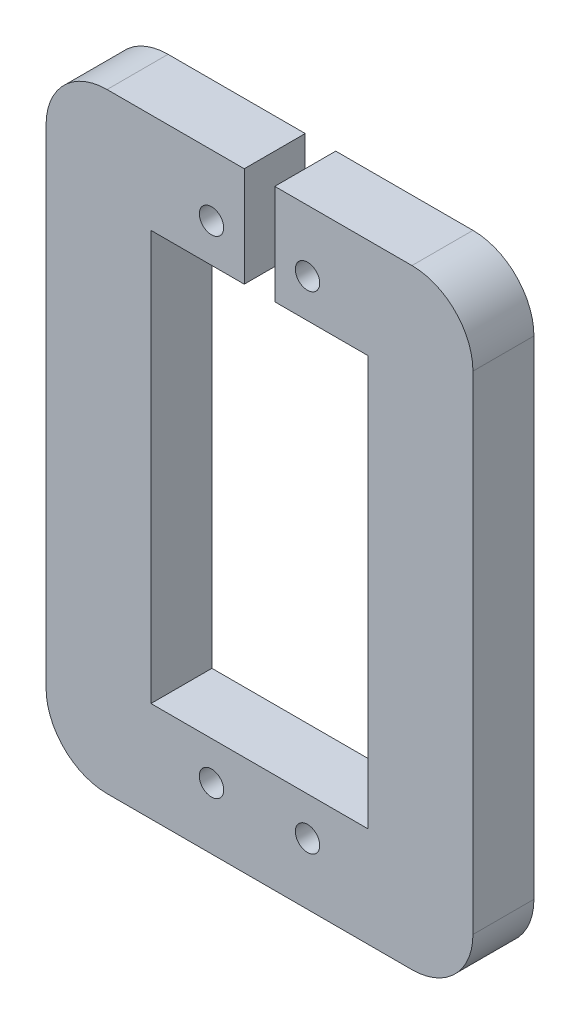
ISO-10303-21;
HEADER;
FILE_DESCRIPTION(('STEP AP214'),'2;1');
FILE_NAME('part.step','',(''),(''),'','','');
FILE_SCHEMA(('AUTOMOTIVE_DESIGN { 1 0 10303 214 1 1 1 1 }'));
ENDSEC;
DATA;
#1=APPLICATION_CONTEXT('core data for automotive mechanical design processes');
#2=APPLICATION_PROTOCOL_DEFINITION('international standard','automotive_design',2000,#1);
#3=PRODUCT_CONTEXT('',#1,'mechanical');
#4=PRODUCT('Part','Part','',(#3));
#5=PRODUCT_RELATED_PRODUCT_CATEGORY('part','',(#4));
#6=PRODUCT_DEFINITION_FORMATION('','',#4);
#7=PRODUCT_DEFINITION_CONTEXT('part definition',#1,'design');
#8=PRODUCT_DEFINITION('design','',#6,#7);
#9=PRODUCT_DEFINITION_SHAPE('','',#8);
#10=(LENGTH_UNIT() NAMED_UNIT(*) SI_UNIT(.MILLI.,.METRE.));
#11=(NAMED_UNIT(*) PLANE_ANGLE_UNIT() SI_UNIT($,.RADIAN.));
#12=(NAMED_UNIT(*) SI_UNIT($,.STERADIAN.) SOLID_ANGLE_UNIT());
#13=UNCERTAINTY_MEASURE_WITH_UNIT(LENGTH_MEASURE(1.E-05),#10,'distance_accuracy_value','');
#14=(GEOMETRIC_REPRESENTATION_CONTEXT(3) GLOBAL_UNCERTAINTY_ASSIGNED_CONTEXT((#13)) GLOBAL_UNIT_ASSIGNED_CONTEXT((#10,
#11,#12)) REPRESENTATION_CONTEXT('',''));
#15=CARTESIAN_POINT('',(0.,0.,0.));
#16=DIRECTION('',(0.,0.,1.));
#17=DIRECTION('',(1.,0.,0.));
#18=AXIS2_PLACEMENT_3D('',#15,#16,#17);
#19=CARTESIAN_POINT('',(-22.225,31.75,6.35));
#20=DIRECTION('',(0.,-1.,0.));
#21=DIRECTION('',(0.,0.,-1.));
#22=AXIS2_PLACEMENT_3D('',#19,#20,#21);
#23=PLANE('',#22);
#24=DIRECTION('',(-1.,0.,0.));
#25=VECTOR('',#24,1.);
#26=CARTESIAN_POINT('',(-22.225,31.75,6.35));
#27=LINE('',#26,#25);
#28=CARTESIAN_POINT('',(15.875,31.75,6.35));
#29=VERTEX_POINT('',#28);
#30=CARTESIAN_POINT('',(1.58749999999999,31.75,6.35));
#31=VERTEX_POINT('',#30);
#32=EDGE_CURVE('E174',#29,#31,#27,.T.);
#33=ORIENTED_EDGE('',*,*,#32,.F.);
#34=DIRECTION('',(0.,0.,-1.));
#35=VECTOR('',#34,1.);
#36=CARTESIAN_POINT('',(15.875,31.75,6.35));
#37=LINE('',#36,#35);
#38=CARTESIAN_POINT('',(15.875,31.75,0.));
#39=VERTEX_POINT('',#38);
#40=EDGE_CURVE('E46',#29,#39,#37,.T.);
#41=ORIENTED_EDGE('',*,*,#40,.T.);
#42=DIRECTION('',(-1.,0.,0.));
#43=VECTOR('',#42,1.);
#44=CARTESIAN_POINT('',(-22.225,31.75,0.));
#45=LINE('',#44,#43);
#46=CARTESIAN_POINT('',(1.58749999999999,31.75,0.));
#47=VERTEX_POINT('',#46);
#48=EDGE_CURVE('E278',#39,#47,#45,.T.);
#49=ORIENTED_EDGE('',*,*,#48,.T.);
#50=DIRECTION('',(0.,0.,1.));
#51=VECTOR('',#50,1.);
#52=CARTESIAN_POINT('',(1.58749999999999,31.75,6.35));
#53=LINE('',#52,#51);
#54=EDGE_CURVE('E218',#47,#31,#53,.T.);
#55=ORIENTED_EDGE('',*,*,#54,.T.);
#56=EDGE_LOOP('',(#33,#41,#49,#55));
#57=FACE_BOUND('',#56,.T.);
#58=ADVANCED_FACE('F38',(#57),#23,.F.);
#59=CARTESIAN_POINT('',(-11.303,21.336,0.));
#60=DIRECTION('',(0.,1.,0.));
#61=DIRECTION('',(0.,0.,1.));
#62=AXIS2_PLACEMENT_3D('',#59,#60,#61);
#63=PLANE('',#62);
#64=DIRECTION('',(-1.,0.,0.));
#65=VECTOR('',#64,1.);
#66=CARTESIAN_POINT('',(-11.303,21.336,6.35));
#67=LINE('',#66,#65);
#68=CARTESIAN_POINT('',(11.303,21.336,6.35));
#69=VERTEX_POINT('',#68);
#70=CARTESIAN_POINT('',(1.5875,21.336,6.35));
#71=VERTEX_POINT('',#70);
#72=EDGE_CURVE('E173',#69,#71,#67,.T.);
#73=ORIENTED_EDGE('',*,*,#72,.T.);
#74=DIRECTION('',(0.,0.,-1.));
#75=VECTOR('',#74,1.);
#76=CARTESIAN_POINT('',(1.5875,21.336,0.));
#77=LINE('',#76,#75);
#78=CARTESIAN_POINT('',(1.5875,21.336,0.));
#79=VERTEX_POINT('',#78);
#80=EDGE_CURVE('E153',#71,#79,#77,.T.);
#81=ORIENTED_EDGE('',*,*,#80,.T.);
#82=DIRECTION('',(-1.,0.,0.));
#83=VECTOR('',#82,1.);
#84=CARTESIAN_POINT('',(-11.303,21.336,0.));
#85=LINE('',#84,#83);
#86=CARTESIAN_POINT('',(11.303,21.336,0.));
#87=VERTEX_POINT('',#86);
#88=EDGE_CURVE('E225',#87,#79,#85,.T.);
#89=ORIENTED_EDGE('',*,*,#88,.F.);
#90=DIRECTION('',(0.,0.,1.));
#91=VECTOR('',#90,1.);
#92=CARTESIAN_POINT('',(11.303,21.336,0.));
#93=LINE('',#92,#91);
#94=EDGE_CURVE('E180',#87,#69,#93,.T.);
#95=ORIENTED_EDGE('',*,*,#94,.T.);
#96=EDGE_LOOP('',(#73,#81,#89,#95));
#97=FACE_BOUND('',#96,.T.);
#98=ADVANCED_FACE('F179',(#97),#63,.F.);
#99=CARTESIAN_POINT('',(0.,0.,6.35));
#100=DIRECTION('',(0.,0.,1.));
#101=DIRECTION('',(1.,0.,0.));
#102=AXIS2_PLACEMENT_3D('',#99,#100,#101);
#103=PLANE('',#102);
#104=DIRECTION('',(1.,0.,0.));
#105=VECTOR('',#104,1.);
#106=CARTESIAN_POINT('',(-22.225,-31.75,6.35));
#107=LINE('',#106,#105);
#108=CARTESIAN_POINT('',(-15.875,-31.75,6.35));
#109=VERTEX_POINT('',#108);
#110=CARTESIAN_POINT('',(15.875,-31.75,6.35));
#111=VERTEX_POINT('',#110);
#112=EDGE_CURVE('E277',#109,#111,#107,.T.);
#113=ORIENTED_EDGE('',*,*,#112,.T.);
#114=CARTESIAN_POINT('',(15.875,-25.4,6.35));
#115=DIRECTION('',(0.,0.,1.));
#116=DIRECTION('',(1.,0.,0.));
#117=AXIS2_PLACEMENT_3D('',#114,#115,#116);
#118=CIRCLE('',#117,6.35);
#119=CARTESIAN_POINT('',(22.225,-25.4,6.35));
#120=VERTEX_POINT('',#119);
#121=EDGE_CURVE('E337',#111,#120,#118,.T.);
#122=ORIENTED_EDGE('',*,*,#121,.T.);
#123=DIRECTION('',(0.,1.,0.));
#124=VECTOR('',#123,1.);
#125=CARTESIAN_POINT('',(22.225,31.75,6.35));
#126=LINE('',#125,#124);
#127=CARTESIAN_POINT('',(22.225,25.4,6.35));
#128=VERTEX_POINT('',#127);
#129=EDGE_CURVE('E302',#120,#128,#126,.T.);
#130=ORIENTED_EDGE('',*,*,#129,.T.);
#131=CARTESIAN_POINT('',(15.875,25.4,6.35));
#132=DIRECTION('',(0.,0.,1.));
#133=DIRECTION('',(1.,0.,0.));
#134=AXIS2_PLACEMENT_3D('',#131,#132,#133);
#135=CIRCLE('',#134,6.35);
#136=EDGE_CURVE('E53',#128,#29,#135,.T.);
#137=ORIENTED_EDGE('',*,*,#136,.T.);
#138=ORIENTED_EDGE('',*,*,#32,.T.);
#139=DIRECTION('',(0.,1.,0.));
#140=VECTOR('',#139,1.);
#141=CARTESIAN_POINT('',(1.58749999999999,35.3398616570786,6.35));
#142=LINE('',#141,#140);
#143=EDGE_CURVE('E157',#71,#31,#142,.T.);
#144=ORIENTED_EDGE('',*,*,#143,.F.);
#145=ORIENTED_EDGE('',*,*,#72,.F.);
#146=DIRECTION('',(0.,1.,0.));
#147=VECTOR('',#146,1.);
#148=CARTESIAN_POINT('',(11.303,-21.336,6.35));
#149=LINE('',#148,#147);
#150=CARTESIAN_POINT('',(11.303,-21.336,6.35));
#151=VERTEX_POINT('',#150);
#152=EDGE_CURVE('E191',#151,#69,#149,.T.);
#153=ORIENTED_EDGE('',*,*,#152,.F.);
#154=DIRECTION('',(1.,0.,0.));
#155=VECTOR('',#154,1.);
#156=CARTESIAN_POINT('',(-11.303,-21.336,6.35));
#157=LINE('',#156,#155);
#158=CARTESIAN_POINT('',(-11.303,-21.336,6.35));
#159=VERTEX_POINT('',#158);
#160=EDGE_CURVE('E188',#159,#151,#157,.T.);
#161=ORIENTED_EDGE('',*,*,#160,.F.);
#162=DIRECTION('',(0.,-1.,0.));
#163=VECTOR('',#162,1.);
#164=CARTESIAN_POINT('',(-11.303,-21.336,6.35));
#165=LINE('',#164,#163);
#166=CARTESIAN_POINT('',(-11.303,21.336,6.35));
#167=VERTEX_POINT('',#166);
#168=EDGE_CURVE('E182',#167,#159,#165,.T.);
#169=ORIENTED_EDGE('',*,*,#168,.F.);
#170=CARTESIAN_POINT('',(-1.58750000000001,21.336,6.35));
#171=VERTEX_POINT('',#170);
#172=EDGE_CURVE('E183',#171,#167,#67,.T.);
#173=ORIENTED_EDGE('',*,*,#172,.F.);
#174=DIRECTION('',(0.,-1.,0.));
#175=VECTOR('',#174,1.);
#176=CARTESIAN_POINT('',(-1.58750000000001,35.3398616570786,6.35));
#177=LINE('',#176,#175);
#178=CARTESIAN_POINT('',(-1.58750000000001,31.75,6.35));
#179=VERTEX_POINT('',#178);
#180=EDGE_CURVE('E176',#179,#171,#177,.T.);
#181=ORIENTED_EDGE('',*,*,#180,.F.);
#182=CARTESIAN_POINT('',(-15.875,31.75,6.35));
#183=VERTEX_POINT('',#182);
#184=EDGE_CURVE('E301',#179,#183,#27,.T.);
#185=ORIENTED_EDGE('',*,*,#184,.T.);
#186=CARTESIAN_POINT('',(-15.875,25.4,6.35));
#187=DIRECTION('',(0.,0.,1.));
#188=DIRECTION('',(1.,0.,0.));
#189=AXIS2_PLACEMENT_3D('',#186,#187,#188);
#190=CIRCLE('',#189,6.35);
#191=CARTESIAN_POINT('',(-22.225,25.4,6.35));
#192=VERTEX_POINT('',#191);
#193=EDGE_CURVE('E282',#183,#192,#190,.T.);
#194=ORIENTED_EDGE('',*,*,#193,.T.);
#195=DIRECTION('',(0.,-1.,0.));
#196=VECTOR('',#195,1.);
#197=CARTESIAN_POINT('',(-22.225,31.75,6.35));
#198=LINE('',#197,#196);
#199=CARTESIAN_POINT('',(-22.225,-25.4,6.35));
#200=VERTEX_POINT('',#199);
#201=EDGE_CURVE('E273',#192,#200,#198,.T.);
#202=ORIENTED_EDGE('',*,*,#201,.T.);
#203=CARTESIAN_POINT('',(-15.875,-25.4,6.35));
#204=DIRECTION('',(0.,0.,1.));
#205=DIRECTION('',(1.,0.,0.));
#206=AXIS2_PLACEMENT_3D('',#203,#204,#205);
#207=CIRCLE('',#206,6.35);
#208=EDGE_CURVE('E291',#200,#109,#207,.T.);
#209=ORIENTED_EDGE('',*,*,#208,.T.);
#210=EDGE_LOOP('',(#113,#122,#130,#137,#138,#144,#145,#153,#161,#169,#173,#181,#185,#194,#202,#209));
#211=FACE_BOUND('',#210,.T.);
#212=CARTESIAN_POINT('',(-5.00041954189573,-25.3522920537674,6.35));
#213=DIRECTION('',(0.,0.,1.));
#214=DIRECTION('',(1.,0.,0.));
#215=AXIS2_PLACEMENT_3D('',#212,#213,#214);
#216=CIRCLE('',#215,1.27);
#217=CARTESIAN_POINT('',(-3.73041954189573,-25.3522920537674,6.35));
#218=VERTEX_POINT('',#217);
#219=EDGE_CURVE('E249',#218,#218,#216,.T.);
#220=ORIENTED_EDGE('',*,*,#219,.F.);
#221=EDGE_LOOP('',(#220));
#222=FACE_BOUND('',#221,.T.);
#223=CARTESIAN_POINT('',(-4.99980681314385,25.351447060519,6.35));
#224=DIRECTION('',(0.,0.,1.));
#225=DIRECTION('',(1.,0.,0.));
#226=AXIS2_PLACEMENT_3D('',#223,#224,#225);
#227=CIRCLE('',#226,1.27);
#228=CARTESIAN_POINT('',(-3.72980681314385,25.351447060519,6.35));
#229=VERTEX_POINT('',#228);
#230=EDGE_CURVE('E262',#229,#229,#227,.T.);
#231=ORIENTED_EDGE('',*,*,#230,.F.);
#232=EDGE_LOOP('',(#231));
#233=FACE_BOUND('',#232,.T.);
#234=CARTESIAN_POINT('',(4.99956519865704,25.3508041357248,6.35));
#235=DIRECTION('',(0.,0.,1.));
#236=DIRECTION('',(1.,0.,0.));
#237=AXIS2_PLACEMENT_3D('',#234,#235,#236);
#238=CIRCLE('',#237,1.27);
#239=CARTESIAN_POINT('',(6.26956519865703,25.3508041357248,6.35));
#240=VERTEX_POINT('',#239);
#241=EDGE_CURVE('E272',#240,#240,#238,.T.);
#242=ORIENTED_EDGE('',*,*,#241,.F.);
#243=EDGE_LOOP('',(#242));
#244=FACE_BOUND('',#243,.T.);
#245=CARTESIAN_POINT('',(4.99980681314388,-25.351447060519,6.35));
#246=DIRECTION('',(0.,0.,1.));
#247=DIRECTION('',(1.,0.,0.));
#248=AXIS2_PLACEMENT_3D('',#245,#246,#247);
#249=CIRCLE('',#248,1.27);
#250=CARTESIAN_POINT('',(6.26980681314388,-25.351447060519,6.35));
#251=VERTEX_POINT('',#250);
#252=EDGE_CURVE('E239',#251,#251,#249,.T.);
#253=ORIENTED_EDGE('',*,*,#252,.F.);
#254=EDGE_LOOP('',(#253));
#255=FACE_BOUND('',#254,.T.);
#256=ADVANCED_FACE('F170',(#211,#222,#233,#244,#255),#103,.T.);
#257=CARTESIAN_POINT('',(0.,0.,0.));
#258=DIRECTION('',(0.,0.,1.));
#259=DIRECTION('',(1.,0.,0.));
#260=AXIS2_PLACEMENT_3D('',#257,#258,#259);
#261=PLANE('',#260);
#262=CARTESIAN_POINT('',(-5.00041954189573,-25.3522920537674,0.));
#263=DIRECTION('',(0.,0.,1.));
#264=DIRECTION('',(1.,0.,0.));
#265=AXIS2_PLACEMENT_3D('',#262,#263,#264);
#266=CIRCLE('',#265,1.27);
#267=CARTESIAN_POINT('',(-3.73041954189573,-25.3522920537674,0.));
#268=VERTEX_POINT('',#267);
#269=EDGE_CURVE('E244',#268,#268,#266,.T.);
#270=ORIENTED_EDGE('',*,*,#269,.T.);
#271=EDGE_LOOP('',(#270));
#272=FACE_BOUND('',#271,.T.);
#273=CARTESIAN_POINT('',(-4.99980681314385,25.351447060519,0.));
#274=DIRECTION('',(0.,0.,1.));
#275=DIRECTION('',(1.,0.,0.));
#276=AXIS2_PLACEMENT_3D('',#273,#274,#275);
#277=CIRCLE('',#276,1.27);
#278=CARTESIAN_POINT('',(-3.72980681314385,25.351447060519,0.));
#279=VERTEX_POINT('',#278);
#280=EDGE_CURVE('E269',#279,#279,#277,.T.);
#281=ORIENTED_EDGE('',*,*,#280,.T.);
#282=EDGE_LOOP('',(#281));
#283=FACE_BOUND('',#282,.T.);
#284=DIRECTION('',(0.,1.,0.));
#285=VECTOR('',#284,1.);
#286=CARTESIAN_POINT('',(22.225,31.75,0.));
#287=LINE('',#286,#285);
#288=CARTESIAN_POINT('',(22.225,-25.4,0.));
#289=VERTEX_POINT('',#288);
#290=CARTESIAN_POINT('',(22.225,25.4,0.));
#291=VERTEX_POINT('',#290);
#292=EDGE_CURVE('E309',#289,#291,#287,.T.);
#293=ORIENTED_EDGE('',*,*,#292,.F.);
#294=CARTESIAN_POINT('',(15.875,-25.4,0.));
#295=DIRECTION('',(0.,0.,1.));
#296=DIRECTION('',(1.,0.,0.));
#297=AXIS2_PLACEMENT_3D('',#294,#295,#296);
#298=CIRCLE('',#297,6.35);
#299=CARTESIAN_POINT('',(15.875,-31.75,0.));
#300=VERTEX_POINT('',#299);
#301=EDGE_CURVE('E326',#289,#300,#298,.F.);
#302=ORIENTED_EDGE('',*,*,#301,.T.);
#303=DIRECTION('',(1.,0.,0.));
#304=VECTOR('',#303,1.);
#305=CARTESIAN_POINT('',(-22.225,-31.75,0.));
#306=LINE('',#305,#304);
#307=CARTESIAN_POINT('',(-15.875,-31.75,0.));
#308=VERTEX_POINT('',#307);
#309=EDGE_CURVE('E306',#308,#300,#306,.T.);
#310=ORIENTED_EDGE('',*,*,#309,.F.);
#311=CARTESIAN_POINT('',(-15.875,-25.4,0.));
#312=DIRECTION('',(0.,0.,1.));
#313=DIRECTION('',(1.,0.,0.));
#314=AXIS2_PLACEMENT_3D('',#311,#312,#313);
#315=CIRCLE('',#314,6.35);
#316=CARTESIAN_POINT('',(-22.225,-25.4,0.));
#317=VERTEX_POINT('',#316);
#318=EDGE_CURVE('E324',#308,#317,#315,.F.);
#319=ORIENTED_EDGE('',*,*,#318,.T.);
#320=DIRECTION('',(0.,-1.,0.));
#321=VECTOR('',#320,1.);
#322=CARTESIAN_POINT('',(-22.225,31.75,0.));
#323=LINE('',#322,#321);
#324=CARTESIAN_POINT('',(-22.225,25.4,0.));
#325=VERTEX_POINT('',#324);
#326=EDGE_CURVE('E268',#325,#317,#323,.T.);
#327=ORIENTED_EDGE('',*,*,#326,.F.);
#328=CARTESIAN_POINT('',(-15.875,25.4,0.));
#329=DIRECTION('',(0.,0.,1.));
#330=DIRECTION('',(1.,0.,0.));
#331=AXIS2_PLACEMENT_3D('',#328,#329,#330);
#332=CIRCLE('',#331,6.35);
#333=CARTESIAN_POINT('',(-15.875,31.75,0.));
#334=VERTEX_POINT('',#333);
#335=EDGE_CURVE('E320',#325,#334,#332,.F.);
#336=ORIENTED_EDGE('',*,*,#335,.T.);
#337=CARTESIAN_POINT('',(-1.58750000000001,31.75,0.));
#338=VERTEX_POINT('',#337);
#339=EDGE_CURVE('E312',#338,#334,#45,.T.);
#340=ORIENTED_EDGE('',*,*,#339,.F.);
#341=DIRECTION('',(0.,-1.,0.));
#342=VECTOR('',#341,1.);
#343=CARTESIAN_POINT('',(-1.58750000000001,35.3398616570786,0.));
#344=LINE('',#343,#342);
#345=CARTESIAN_POINT('',(-1.5875,21.336,0.));
#346=VERTEX_POINT('',#345);
#347=EDGE_CURVE('E219',#338,#346,#344,.T.);
#348=ORIENTED_EDGE('',*,*,#347,.T.);
#349=CARTESIAN_POINT('',(-11.303,21.336,0.));
#350=VERTEX_POINT('',#349);
#351=EDGE_CURVE('E224',#346,#350,#85,.T.);
#352=ORIENTED_EDGE('',*,*,#351,.T.);
#353=DIRECTION('',(0.,-1.,0.));
#354=VECTOR('',#353,1.);
#355=CARTESIAN_POINT('',(-11.303,-21.336,0.));
#356=LINE('',#355,#354);
#357=CARTESIAN_POINT('',(-11.303,-21.336,0.));
#358=VERTEX_POINT('',#357);
#359=EDGE_CURVE('E227',#350,#358,#356,.T.);
#360=ORIENTED_EDGE('',*,*,#359,.T.);
#361=DIRECTION('',(1.,0.,0.));
#362=VECTOR('',#361,1.);
#363=CARTESIAN_POINT('',(-11.303,-21.336,0.));
#364=LINE('',#363,#362);
#365=CARTESIAN_POINT('',(11.303,-21.336,0.));
#366=VERTEX_POINT('',#365);
#367=EDGE_CURVE('E229',#358,#366,#364,.T.);
#368=ORIENTED_EDGE('',*,*,#367,.T.);
#369=DIRECTION('',(0.,1.,0.));
#370=VECTOR('',#369,1.);
#371=CARTESIAN_POINT('',(11.303,-21.336,0.));
#372=LINE('',#371,#370);
#373=EDGE_CURVE('E221',#366,#87,#372,.T.);
#374=ORIENTED_EDGE('',*,*,#373,.T.);
#375=ORIENTED_EDGE('',*,*,#88,.T.);
#376=DIRECTION('',(0.,1.,0.));
#377=VECTOR('',#376,1.);
#378=CARTESIAN_POINT('',(1.58749999999999,35.3398616570786,0.));
#379=LINE('',#378,#377);
#380=EDGE_CURVE('E160',#79,#47,#379,.T.);
#381=ORIENTED_EDGE('',*,*,#380,.T.);
#382=ORIENTED_EDGE('',*,*,#48,.F.);
#383=CARTESIAN_POINT('',(15.875,25.4,0.));
#384=DIRECTION('',(0.,0.,1.));
#385=DIRECTION('',(1.,0.,0.));
#386=AXIS2_PLACEMENT_3D('',#383,#384,#385);
#387=CIRCLE('',#386,6.35);
#388=EDGE_CURVE('E322',#39,#291,#387,.F.);
#389=ORIENTED_EDGE('',*,*,#388,.T.);
#390=EDGE_LOOP('',(#293,#302,#310,#319,#327,#336,#340,#348,#352,#360,#368,#374,#375,#381,#382,#389));
#391=FACE_BOUND('',#390,.T.);
#392=CARTESIAN_POINT('',(4.99956519865704,25.3508041357248,0.));
#393=DIRECTION('',(0.,0.,1.));
#394=DIRECTION('',(1.,0.,0.));
#395=AXIS2_PLACEMENT_3D('',#392,#393,#394);
#396=CIRCLE('',#395,1.27);
#397=CARTESIAN_POINT('',(6.26956519865703,25.3508041357248,0.));
#398=VERTEX_POINT('',#397);
#399=EDGE_CURVE('E254',#398,#398,#396,.T.);
#400=ORIENTED_EDGE('',*,*,#399,.T.);
#401=EDGE_LOOP('',(#400));
#402=FACE_BOUND('',#401,.T.);
#403=CARTESIAN_POINT('',(4.99980681314388,-25.351447060519,0.));
#404=DIRECTION('',(0.,0.,1.));
#405=DIRECTION('',(1.,0.,0.));
#406=AXIS2_PLACEMENT_3D('',#403,#404,#405);
#407=CIRCLE('',#406,1.27);
#408=CARTESIAN_POINT('',(6.26980681314388,-25.351447060519,0.));
#409=VERTEX_POINT('',#408);
#410=EDGE_CURVE('E245',#409,#409,#407,.T.);
#411=ORIENTED_EDGE('',*,*,#410,.T.);
#412=EDGE_LOOP('',(#411));
#413=FACE_BOUND('',#412,.T.);
#414=ADVANCED_FACE('F358',(#272,#283,#391,#402,#413),#261,.F.);
#415=CARTESIAN_POINT('',(-22.225,31.75,6.35));
#416=DIRECTION('',(1.,0.,0.));
#417=DIRECTION('',(0.,1.,0.));
#418=AXIS2_PLACEMENT_3D('',#415,#416,#417);
#419=PLANE('',#418);
#420=ORIENTED_EDGE('',*,*,#326,.T.);
#421=DIRECTION('',(0.,0.,-1.));
#422=VECTOR('',#421,1.);
#423=CARTESIAN_POINT('',(-22.225,-25.4,6.35));
#424=LINE('',#423,#422);
#425=EDGE_CURVE('E61',#317,#200,#424,.F.);
#426=ORIENTED_EDGE('',*,*,#425,.T.);
#427=ORIENTED_EDGE('',*,*,#201,.F.);
#428=DIRECTION('',(0.,0.,-1.));
#429=VECTOR('',#428,1.);
#430=CARTESIAN_POINT('',(-22.225,25.4,6.35));
#431=LINE('',#430,#429);
#432=EDGE_CURVE('E344',#192,#325,#431,.T.);
#433=ORIENTED_EDGE('',*,*,#432,.T.);
#434=EDGE_LOOP('',(#420,#426,#427,#433));
#435=FACE_BOUND('',#434,.T.);
#436=ADVANCED_FACE('F423',(#435),#419,.F.);
#437=CARTESIAN_POINT('',(-22.225,-31.75,6.35));
#438=DIRECTION('',(0.,1.,0.));
#439=DIRECTION('',(0.,0.,1.));
#440=AXIS2_PLACEMENT_3D('',#437,#438,#439);
#441=PLANE('',#440);
#442=ORIENTED_EDGE('',*,*,#309,.T.);
#443=DIRECTION('',(0.,0.,-1.));
#444=VECTOR('',#443,1.);
#445=CARTESIAN_POINT('',(15.875,-31.75,6.35));
#446=LINE('',#445,#444);
#447=EDGE_CURVE('E287',#300,#111,#446,.F.);
#448=ORIENTED_EDGE('',*,*,#447,.T.);
#449=ORIENTED_EDGE('',*,*,#112,.F.);
#450=DIRECTION('',(0.,0.,-1.));
#451=VECTOR('',#450,1.);
#452=CARTESIAN_POINT('',(-15.875,-31.75,6.35));
#453=LINE('',#452,#451);
#454=EDGE_CURVE('E327',#109,#308,#453,.T.);
#455=ORIENTED_EDGE('',*,*,#454,.T.);
#456=EDGE_LOOP('',(#442,#448,#449,#455));
#457=FACE_BOUND('',#456,.T.);
#458=ADVANCED_FACE('F334',(#457),#441,.F.);
#459=CARTESIAN_POINT('',(22.225,31.75,6.35));
#460=DIRECTION('',(-1.,0.,0.));
#461=DIRECTION('',(0.,-1.,0.));
#462=AXIS2_PLACEMENT_3D('',#459,#460,#461);
#463=PLANE('',#462);
#464=ORIENTED_EDGE('',*,*,#129,.F.);
#465=DIRECTION('',(0.,0.,-1.));
#466=VECTOR('',#465,1.);
#467=CARTESIAN_POINT('',(22.225,-25.4,6.35));
#468=LINE('',#467,#466);
#469=EDGE_CURVE('E317',#120,#289,#468,.T.);
#470=ORIENTED_EDGE('',*,*,#469,.T.);
#471=ORIENTED_EDGE('',*,*,#292,.T.);
#472=DIRECTION('',(0.,0.,-1.));
#473=VECTOR('',#472,1.);
#474=CARTESIAN_POINT('',(22.225,25.4,6.35));
#475=LINE('',#474,#473);
#476=EDGE_CURVE('E165',#291,#128,#475,.F.);
#477=ORIENTED_EDGE('',*,*,#476,.T.);
#478=EDGE_LOOP('',(#464,#470,#471,#477));
#479=FACE_BOUND('',#478,.T.);
#480=ADVANCED_FACE('F407',(#479),#463,.F.);
#481=ORIENTED_EDGE('',*,*,#339,.T.);
#482=DIRECTION('',(0.,0.,-1.));
#483=VECTOR('',#482,1.);
#484=CARTESIAN_POINT('',(-15.875,31.75,6.35));
#485=LINE('',#484,#483);
#486=EDGE_CURVE('E12',#334,#183,#485,.F.);
#487=ORIENTED_EDGE('',*,*,#486,.T.);
#488=ORIENTED_EDGE('',*,*,#184,.F.);
#489=DIRECTION('',(0.,0.,-1.));
#490=VECTOR('',#489,1.);
#491=CARTESIAN_POINT('',(-1.58750000000001,31.75,6.35));
#492=LINE('',#491,#490);
#493=EDGE_CURVE('E215',#179,#338,#492,.T.);
#494=ORIENTED_EDGE('',*,*,#493,.T.);
#495=EDGE_LOOP('',(#481,#487,#488,#494));
#496=FACE_BOUND('',#495,.T.);
#497=ADVANCED_FACE('F399',(#496),#23,.F.);
#498=CARTESIAN_POINT('',(-4.99980681314385,25.351447060519,6.35));
#499=DIRECTION('',(0.,0.,-1.));
#500=DIRECTION('',(-1.,0.,0.));
#501=AXIS2_PLACEMENT_3D('',#498,#499,#500);
#502=CYLINDRICAL_SURFACE('',#501,1.27);
#503=ORIENTED_EDGE('',*,*,#230,.T.);
#504=EDGE_LOOP('',(#503));
#505=FACE_BOUND('',#504,.T.);
#506=ORIENTED_EDGE('',*,*,#280,.F.);
#507=EDGE_LOOP('',(#506));
#508=FACE_BOUND('',#507,.T.);
#509=ADVANCED_FACE('F406',(#505,#508),#502,.F.);
#510=CARTESIAN_POINT('',(4.99956519865704,25.3508041357248,6.35));
#511=DIRECTION('',(0.,0.,-1.));
#512=DIRECTION('',(-1.,0.,0.));
#513=AXIS2_PLACEMENT_3D('',#510,#511,#512);
#514=CYLINDRICAL_SURFACE('',#513,1.27);
#515=ORIENTED_EDGE('',*,*,#241,.T.);
#516=EDGE_LOOP('',(#515));
#517=FACE_BOUND('',#516,.T.);
#518=ORIENTED_EDGE('',*,*,#399,.F.);
#519=EDGE_LOOP('',(#518));
#520=FACE_BOUND('',#519,.T.);
#521=ADVANCED_FACE('F413',(#517,#520),#514,.F.);
#522=CARTESIAN_POINT('',(-5.00041954189573,-25.3522920537674,6.35));
#523=DIRECTION('',(0.,0.,-1.));
#524=DIRECTION('',(-1.,0.,0.));
#525=AXIS2_PLACEMENT_3D('',#522,#523,#524);
#526=CYLINDRICAL_SURFACE('',#525,1.27);
#527=ORIENTED_EDGE('',*,*,#219,.T.);
#528=EDGE_LOOP('',(#527));
#529=FACE_BOUND('',#528,.T.);
#530=ORIENTED_EDGE('',*,*,#269,.F.);
#531=EDGE_LOOP('',(#530));
#532=FACE_BOUND('',#531,.T.);
#533=ADVANCED_FACE('F393',(#529,#532),#526,.F.);
#534=CARTESIAN_POINT('',(4.99980681314388,-25.351447060519,6.35));
#535=DIRECTION('',(0.,0.,-1.));
#536=DIRECTION('',(-1.,0.,0.));
#537=AXIS2_PLACEMENT_3D('',#534,#535,#536);
#538=CYLINDRICAL_SURFACE('',#537,1.27);
#539=ORIENTED_EDGE('',*,*,#252,.T.);
#540=EDGE_LOOP('',(#539));
#541=FACE_BOUND('',#540,.T.);
#542=ORIENTED_EDGE('',*,*,#410,.F.);
#543=EDGE_LOOP('',(#542));
#544=FACE_BOUND('',#543,.T.);
#545=ADVANCED_FACE('F386',(#541,#544),#538,.F.);
#546=CARTESIAN_POINT('',(11.303,-21.336,0.));
#547=DIRECTION('',(1.,0.,0.));
#548=DIRECTION('',(0.,0.,-1.));
#549=AXIS2_PLACEMENT_3D('',#546,#547,#548);
#550=PLANE('',#549);
#551=ORIENTED_EDGE('',*,*,#152,.T.);
#552=ORIENTED_EDGE('',*,*,#94,.F.);
#553=ORIENTED_EDGE('',*,*,#373,.F.);
#554=DIRECTION('',(0.,0.,1.));
#555=VECTOR('',#554,1.);
#556=CARTESIAN_POINT('',(11.303,-21.336,0.));
#557=LINE('',#556,#555);
#558=EDGE_CURVE('E248',#366,#151,#557,.T.);
#559=ORIENTED_EDGE('',*,*,#558,.T.);
#560=EDGE_LOOP('',(#551,#552,#553,#559));
#561=FACE_BOUND('',#560,.T.);
#562=ADVANCED_FACE('F384',(#561),#550,.F.);
#563=CARTESIAN_POINT('',(-11.303,-21.336,0.));
#564=DIRECTION('',(0.,-1.,0.));
#565=DIRECTION('',(0.,0.,-1.));
#566=AXIS2_PLACEMENT_3D('',#563,#564,#565);
#567=PLANE('',#566);
#568=ORIENTED_EDGE('',*,*,#160,.T.);
#569=ORIENTED_EDGE('',*,*,#558,.F.);
#570=ORIENTED_EDGE('',*,*,#367,.F.);
#571=DIRECTION('',(0.,0.,1.));
#572=VECTOR('',#571,1.);
#573=CARTESIAN_POINT('',(-11.303,-21.336,0.));
#574=LINE('',#573,#572);
#575=EDGE_CURVE('E236',#358,#159,#574,.T.);
#576=ORIENTED_EDGE('',*,*,#575,.T.);
#577=EDGE_LOOP('',(#568,#569,#570,#576));
#578=FACE_BOUND('',#577,.T.);
#579=ADVANCED_FACE('F381',(#578),#567,.F.);
#580=CARTESIAN_POINT('',(-11.303,-21.336,0.));
#581=DIRECTION('',(-1.,0.,0.));
#582=DIRECTION('',(0.,0.,1.));
#583=AXIS2_PLACEMENT_3D('',#580,#581,#582);
#584=PLANE('',#583);
#585=ORIENTED_EDGE('',*,*,#168,.T.);
#586=ORIENTED_EDGE('',*,*,#575,.F.);
#587=ORIENTED_EDGE('',*,*,#359,.F.);
#588=DIRECTION('',(0.,0.,1.));
#589=VECTOR('',#588,1.);
#590=CARTESIAN_POINT('',(-11.303,21.336,0.));
#591=LINE('',#590,#589);
#592=EDGE_CURVE('E233',#350,#167,#591,.T.);
#593=ORIENTED_EDGE('',*,*,#592,.T.);
#594=EDGE_LOOP('',(#585,#586,#587,#593));
#595=FACE_BOUND('',#594,.T.);
#596=ADVANCED_FACE('F373',(#595),#584,.F.);
#597=ORIENTED_EDGE('',*,*,#351,.F.);
#598=DIRECTION('',(0.,0.,1.));
#599=VECTOR('',#598,1.);
#600=CARTESIAN_POINT('',(-1.5875,21.336,0.));
#601=LINE('',#600,#599);
#602=EDGE_CURVE('E166',#346,#171,#601,.T.);
#603=ORIENTED_EDGE('',*,*,#602,.T.);
#604=ORIENTED_EDGE('',*,*,#172,.T.);
#605=ORIENTED_EDGE('',*,*,#592,.F.);
#606=EDGE_LOOP('',(#597,#603,#604,#605));
#607=FACE_BOUND('',#606,.T.);
#608=ADVANCED_FACE('F369',(#607),#63,.F.);
#609=CARTESIAN_POINT('',(-1.58750000000001,35.3398616570786,0.));
#610=DIRECTION('',(-1.,0.,0.));
#611=DIRECTION('',(0.,-1.,0.));
#612=AXIS2_PLACEMENT_3D('',#609,#610,#611);
#613=PLANE('',#612);
#614=ORIENTED_EDGE('',*,*,#180,.T.);
#615=ORIENTED_EDGE('',*,*,#602,.F.);
#616=ORIENTED_EDGE('',*,*,#347,.F.);
#617=ORIENTED_EDGE('',*,*,#493,.F.);
#618=EDGE_LOOP('',(#614,#615,#616,#617));
#619=FACE_BOUND('',#618,.T.);
#620=ADVANCED_FACE('F485',(#619),#613,.F.);
#621=CARTESIAN_POINT('',(1.58749999999999,35.3398616570786,0.));
#622=DIRECTION('',(1.,0.,0.));
#623=DIRECTION('',(0.,1.,0.));
#624=AXIS2_PLACEMENT_3D('',#621,#622,#623);
#625=PLANE('',#624);
#626=ORIENTED_EDGE('',*,*,#380,.F.);
#627=ORIENTED_EDGE('',*,*,#80,.F.);
#628=ORIENTED_EDGE('',*,*,#143,.T.);
#629=ORIENTED_EDGE('',*,*,#54,.F.);
#630=EDGE_LOOP('',(#626,#627,#628,#629));
#631=FACE_BOUND('',#630,.T.);
#632=ADVANCED_FACE('F155',(#631),#625,.F.);
#633=CARTESIAN_POINT('',(15.875,-25.4,6.35));
#634=DIRECTION('',(0.,0.,-1.));
#635=DIRECTION('',(-1.,0.,0.));
#636=AXIS2_PLACEMENT_3D('',#633,#634,#635);
#637=CYLINDRICAL_SURFACE('',#636,6.35);
#638=ORIENTED_EDGE('',*,*,#121,.F.);
#639=ORIENTED_EDGE('',*,*,#447,.F.);
#640=ORIENTED_EDGE('',*,*,#301,.F.);
#641=ORIENTED_EDGE('',*,*,#469,.F.);
#642=EDGE_LOOP('',(#638,#639,#640,#641));
#643=FACE_BOUND('',#642,.T.);
#644=ADVANCED_FACE('F342',(#643),#637,.T.);
#645=CARTESIAN_POINT('',(-15.875,-25.4,6.35));
#646=DIRECTION('',(0.,0.,-1.));
#647=DIRECTION('',(-1.,0.,0.));
#648=AXIS2_PLACEMENT_3D('',#645,#646,#647);
#649=CYLINDRICAL_SURFACE('',#648,6.35);
#650=ORIENTED_EDGE('',*,*,#208,.F.);
#651=ORIENTED_EDGE('',*,*,#425,.F.);
#652=ORIENTED_EDGE('',*,*,#318,.F.);
#653=ORIENTED_EDGE('',*,*,#454,.F.);
#654=EDGE_LOOP('',(#650,#651,#652,#653));
#655=FACE_BOUND('',#654,.T.);
#656=ADVANCED_FACE('F426',(#655),#649,.T.);
#657=CARTESIAN_POINT('',(15.875,25.4,6.35));
#658=DIRECTION('',(0.,0.,-1.));
#659=DIRECTION('',(-1.,0.,0.));
#660=AXIS2_PLACEMENT_3D('',#657,#658,#659);
#661=CYLINDRICAL_SURFACE('',#660,6.35);
#662=ORIENTED_EDGE('',*,*,#136,.F.);
#663=ORIENTED_EDGE('',*,*,#476,.F.);
#664=ORIENTED_EDGE('',*,*,#388,.F.);
#665=ORIENTED_EDGE('',*,*,#40,.F.);
#666=EDGE_LOOP('',(#662,#663,#664,#665));
#667=FACE_BOUND('',#666,.T.);
#668=ADVANCED_FACE('F428',(#667),#661,.T.);
#669=CARTESIAN_POINT('',(-15.875,25.4,6.35));
#670=DIRECTION('',(0.,0.,-1.));
#671=DIRECTION('',(-1.,0.,0.));
#672=AXIS2_PLACEMENT_3D('',#669,#670,#671);
#673=CYLINDRICAL_SURFACE('',#672,6.35);
#674=ORIENTED_EDGE('',*,*,#193,.F.);
#675=ORIENTED_EDGE('',*,*,#486,.F.);
#676=ORIENTED_EDGE('',*,*,#335,.F.);
#677=ORIENTED_EDGE('',*,*,#432,.F.);
#678=EDGE_LOOP('',(#674,#675,#676,#677));
#679=FACE_BOUND('',#678,.T.);
#680=ADVANCED_FACE('F40',(#679),#673,.T.);
#681=CLOSED_SHELL('',(#58,#98,#256,#414,#436,#458,#480,#497,#509,#521,#533,#545,#562,#579,#596,
#608,#620,#632,#644,#656,#668,#680));
#682=MANIFOLD_SOLID_BREP('B2',#681);
#683=ADVANCED_BREP_SHAPE_REPRESENTATION('',(#18,#682),#14);
#684=SHAPE_DEFINITION_REPRESENTATION(#9,#683);
ENDSEC;
END-ISO-10303-21;
